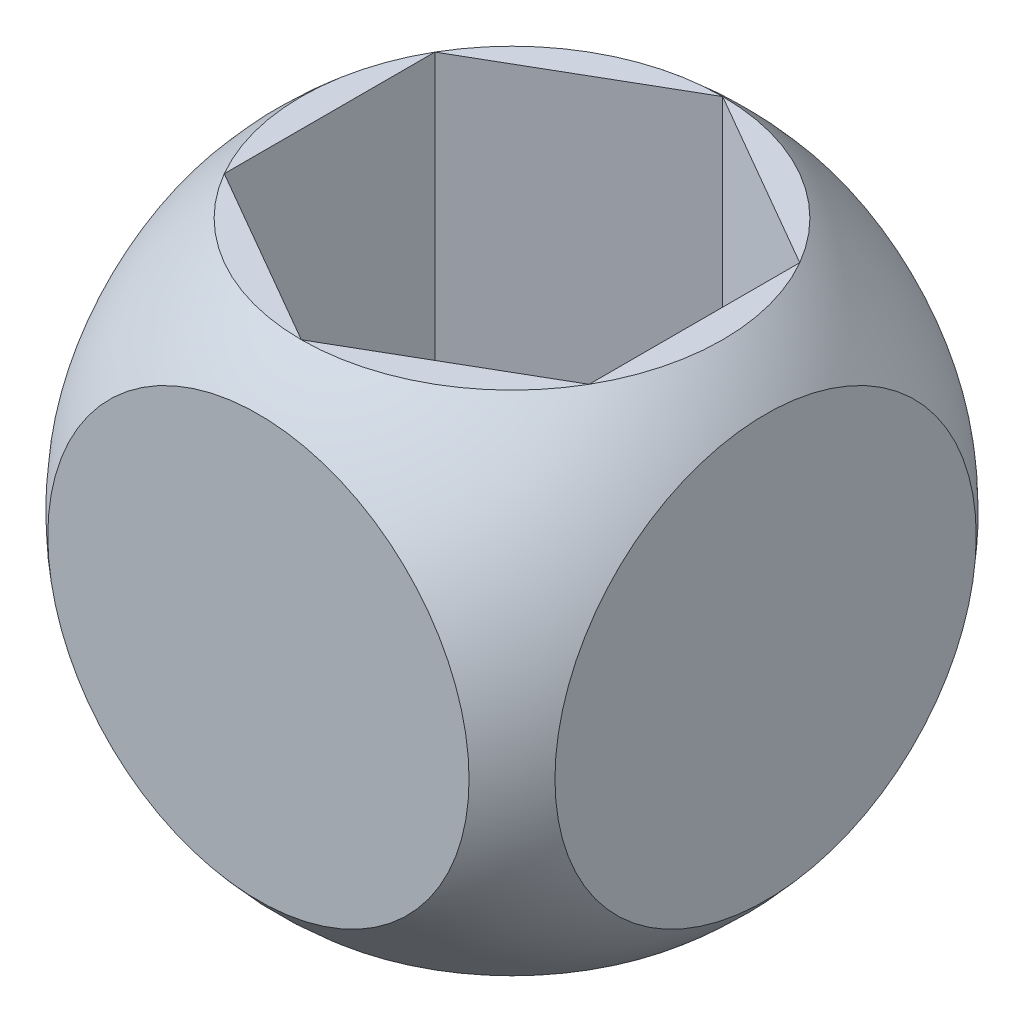
ISO-10303-21;
HEADER;
FILE_DESCRIPTION(('STEP AP214'),'2;1');
FILE_NAME('part.step','',(''),(''),'','','');
FILE_SCHEMA(('AUTOMOTIVE_DESIGN { 1 0 10303 214 1 1 1 1 }'));
ENDSEC;
DATA;
#1=APPLICATION_CONTEXT('core data for automotive mechanical design processes');
#2=APPLICATION_PROTOCOL_DEFINITION('international standard','automotive_design',2000,#1);
#3=PRODUCT_CONTEXT('',#1,'mechanical');
#4=PRODUCT('Part','Part','',(#3));
#5=PRODUCT_RELATED_PRODUCT_CATEGORY('part','',(#4));
#6=PRODUCT_DEFINITION_FORMATION('','',#4);
#7=PRODUCT_DEFINITION_CONTEXT('part definition',#1,'design');
#8=PRODUCT_DEFINITION('design','',#6,#7);
#9=PRODUCT_DEFINITION_SHAPE('','',#8);
#10=(LENGTH_UNIT() NAMED_UNIT(*) SI_UNIT(.MILLI.,.METRE.));
#11=(NAMED_UNIT(*) PLANE_ANGLE_UNIT() SI_UNIT($,.RADIAN.));
#12=(NAMED_UNIT(*) SI_UNIT($,.STERADIAN.) SOLID_ANGLE_UNIT());
#13=UNCERTAINTY_MEASURE_WITH_UNIT(LENGTH_MEASURE(1.E-05),#10,'distance_accuracy_value','');
#14=(GEOMETRIC_REPRESENTATION_CONTEXT(3) GLOBAL_UNCERTAINTY_ASSIGNED_CONTEXT((#13)) GLOBAL_UNIT_ASSIGNED_CONTEXT((#10,
#11,#12)) REPRESENTATION_CONTEXT('',''));
#15=CARTESIAN_POINT('',(0.,0.,0.));
#16=DIRECTION('',(0.,0.,1.));
#17=DIRECTION('',(1.,0.,0.));
#18=AXIS2_PLACEMENT_3D('',#15,#16,#17);
#19=CARTESIAN_POINT('',(50.,50.,-50.));
#20=DIRECTION('',(0.,1.,0.));
#21=DIRECTION('',(-1.,0.,0.));
#22=AXIS2_PLACEMENT_3D('',#19,#20,#21);
#23=PLANE('',#22);
#24=DIRECTION('',(-0.866025403784442,0.,-0.499999999999995));
#25=VECTOR('',#24,1.);
#26=CARTESIAN_POINT('',(35.9687364248451,50.,-20.7665596572956));
#27=LINE('',#26,#25);
#28=CARTESIAN_POINT('',(35.9687364248451,50.,-20.7665596572956));
#29=VERTEX_POINT('',#28);
#30=CARTESIAN_POINT('',(0.,50.,-41.5331193145904));
#31=VERTEX_POINT('',#30);
#32=EDGE_CURVE('E50',#29,#31,#27,.T.);
#33=ORIENTED_EDGE('',*,*,#32,.F.);
#34=CARTESIAN_POINT('',(0.,50.,0.));
#35=DIRECTION('',(0.,1.,0.));
#36=DIRECTION('',(-1.,0.,0.));
#37=AXIS2_PLACEMENT_3D('',#34,#35,#36);
#38=CIRCLE('',#37,41.5331193145904);
#39=EDGE_CURVE('E124',#29,#31,#38,.T.);
#40=ORIENTED_EDGE('',*,*,#39,.T.);
#41=EDGE_LOOP('',(#33,#40));
#42=FACE_BOUND('',#41,.T.);
#43=ADVANCED_FACE('F33',(#42),#23,.T.);
#44=DIRECTION('',(0.,0.,-1.));
#45=VECTOR('',#44,1.);
#46=CARTESIAN_POINT('',(35.9687364248456,50.,20.7665596572949));
#47=LINE('',#46,#45);
#48=CARTESIAN_POINT('',(35.9687364248456,50.,20.7665596572949));
#49=VERTEX_POINT('',#48);
#50=EDGE_CURVE('E166',#49,#29,#47,.T.);
#51=ORIENTED_EDGE('',*,*,#50,.F.);
#52=EDGE_CURVE('E125',#49,#29,#38,.T.);
#53=ORIENTED_EDGE('',*,*,#52,.T.);
#54=EDGE_LOOP('',(#51,#53));
#55=FACE_BOUND('',#54,.T.);
#56=ADVANCED_FACE('F203',(#55),#23,.T.);
#57=DIRECTION('',(0.866025403784435,0.,-0.500000000000007));
#58=VECTOR('',#57,1.);
#59=CARTESIAN_POINT('',(2.83085328157768E-13,50.,41.5331193145904));
#60=LINE('',#59,#58);
#61=CARTESIAN_POINT('',(2.83085328157768E-13,50.,41.5331193145904));
#62=VERTEX_POINT('',#61);
#63=EDGE_CURVE('E176',#62,#49,#60,.T.);
#64=ORIENTED_EDGE('',*,*,#63,.F.);
#65=EDGE_CURVE('E126',#62,#49,#38,.T.);
#66=ORIENTED_EDGE('',*,*,#65,.T.);
#67=EDGE_LOOP('',(#64,#66));
#68=FACE_BOUND('',#67,.T.);
#69=ADVANCED_FACE('F189',(#68),#23,.T.);
#70=DIRECTION('',(0.866025403784442,0.,0.499999999999995));
#71=VECTOR('',#70,1.);
#72=CARTESIAN_POINT('',(-35.9687364248453,50.,20.7665596572953));
#73=LINE('',#72,#71);
#74=CARTESIAN_POINT('',(-35.9687364248453,50.,20.7665596572953));
#75=VERTEX_POINT('',#74);
#76=EDGE_CURVE('E112',#75,#62,#73,.T.);
#77=ORIENTED_EDGE('',*,*,#76,.F.);
#78=EDGE_CURVE('E42',#75,#62,#38,.T.);
#79=ORIENTED_EDGE('',*,*,#78,.T.);
#80=EDGE_LOOP('',(#77,#79));
#81=FACE_BOUND('',#80,.T.);
#82=ADVANCED_FACE('F195',(#81),#23,.T.);
#83=DIRECTION('',(0.,0.,1.));
#84=VECTOR('',#83,1.);
#85=CARTESIAN_POINT('',(-35.9687364248454,50.,-20.7665596572951));
#86=LINE('',#85,#84);
#87=CARTESIAN_POINT('',(-35.9687364248454,50.,-20.7665596572951));
#88=VERTEX_POINT('',#87);
#89=EDGE_CURVE('E91',#88,#75,#86,.T.);
#90=ORIENTED_EDGE('',*,*,#89,.F.);
#91=EDGE_CURVE('E110',#88,#75,#38,.T.);
#92=ORIENTED_EDGE('',*,*,#91,.T.);
#93=EDGE_LOOP('',(#90,#92));
#94=FACE_BOUND('',#93,.T.);
#95=ADVANCED_FACE('F109',(#94),#23,.T.);
#96=CARTESIAN_POINT('',(50.,-50.,-50.));
#97=DIRECTION('',(0.,-1.,0.));
#98=DIRECTION('',(1.,0.,0.));
#99=AXIS2_PLACEMENT_3D('',#96,#97,#98);
#100=PLANE('',#99);
#101=DIRECTION('',(0.866025403784442,0.,0.499999999999995));
#102=VECTOR('',#101,1.);
#103=CARTESIAN_POINT('',(33.833733117812,-50.,-21.9992043913319));
#104=LINE('',#103,#102);
#105=CARTESIAN_POINT('',(0.,-50.,-41.5331193145904));
#106=VERTEX_POINT('',#105);
#107=CARTESIAN_POINT('',(35.9687364248452,-50.,-20.7665596572956));
#108=VERTEX_POINT('',#107);
#109=EDGE_CURVE('E153',#106,#108,#104,.T.);
#110=ORIENTED_EDGE('',*,*,#109,.F.);
#111=CARTESIAN_POINT('',(0.,-50.,0.));
#112=DIRECTION('',(0.,-1.,0.));
#113=DIRECTION('',(1.,0.,0.));
#114=AXIS2_PLACEMENT_3D('',#111,#112,#113);
#115=CIRCLE('',#114,41.5331193145904);
#116=EDGE_CURVE('E140',#106,#108,#115,.T.);
#117=ORIENTED_EDGE('',*,*,#116,.T.);
#118=EDGE_LOOP('',(#110,#117));
#119=FACE_BOUND('',#118,.T.);
#120=ADVANCED_FACE('F202',(#119),#100,.T.);
#121=DIRECTION('',(0.,0.,1.));
#122=VECTOR('',#121,1.);
#123=CARTESIAN_POINT('',(35.9687364248448,-50.,-49.9999999999999));
#124=LINE('',#123,#122);
#125=CARTESIAN_POINT('',(35.9687364248456,-50.,20.7665596572949));
#126=VERTEX_POINT('',#125);
#127=EDGE_CURVE('E156',#108,#126,#124,.T.);
#128=ORIENTED_EDGE('',*,*,#127,.F.);
#129=EDGE_CURVE('E133',#108,#126,#115,.T.);
#130=ORIENTED_EDGE('',*,*,#129,.T.);
#131=EDGE_LOOP('',(#128,#130));
#132=FACE_BOUND('',#131,.T.);
#133=ADVANCED_FACE('F257',(#132),#100,.T.);
#134=DIRECTION('',(-0.866025403784435,0.,0.500000000000007));
#135=VECTOR('',#134,1.);
#136=CARTESIAN_POINT('',(77.1350033070338,-50.,-3.0007956086689));
#137=LINE('',#136,#135);
#138=CARTESIAN_POINT('',(2.8796409701215E-13,-50.,41.5331193145904));
#139=VERTEX_POINT('',#138);
#140=EDGE_CURVE('E158',#126,#139,#137,.T.);
#141=ORIENTED_EDGE('',*,*,#140,.F.);
#142=EDGE_CURVE('E37',#126,#139,#115,.T.);
#143=ORIENTED_EDGE('',*,*,#142,.T.);
#144=EDGE_LOOP('',(#141,#143));
#145=FACE_BOUND('',#144,.T.);
#146=ADVANCED_FACE('F254',(#145),#100,.T.);
#147=DIRECTION('',(-0.866025403784442,0.,-0.499999999999995));
#148=VECTOR('',#147,1.);
#149=CARTESIAN_POINT('',(-2.13500330703307,-50.,40.3004745805539));
#150=LINE('',#149,#148);
#151=CARTESIAN_POINT('',(-35.9687364248453,-50.,20.7665596572953));
#152=VERTEX_POINT('',#151);
#153=EDGE_CURVE('E160',#139,#152,#150,.T.);
#154=ORIENTED_EDGE('',*,*,#153,.F.);
#155=EDGE_CURVE('E132',#139,#152,#115,.T.);
#156=ORIENTED_EDGE('',*,*,#155,.T.);
#157=EDGE_LOOP('',(#154,#156));
#158=FACE_BOUND('',#157,.T.);
#159=ADVANCED_FACE('F256',(#158),#100,.T.);
#160=DIRECTION('',(0.,0.,-1.));
#161=VECTOR('',#160,1.);
#162=CARTESIAN_POINT('',(-35.9687364248455,-50.,-49.9999999999997));
#163=LINE('',#162,#161);
#164=CARTESIAN_POINT('',(-35.9687364248455,-50.,-20.7665596572951));
#165=VERTEX_POINT('',#164);
#166=EDGE_CURVE('E94',#152,#165,#163,.T.);
#167=ORIENTED_EDGE('',*,*,#166,.F.);
#168=EDGE_CURVE('E138',#152,#165,#115,.T.);
#169=ORIENTED_EDGE('',*,*,#168,.T.);
#170=EDGE_LOOP('',(#167,#169));
#171=FACE_BOUND('',#170,.T.);
#172=ADVANCED_FACE('F220',(#171),#100,.T.);
#173=CARTESIAN_POINT('',(-50.,-50.,-50.));
#174=DIRECTION('',(-1.,0.,0.));
#175=DIRECTION('',(0.,0.,1.));
#176=AXIS2_PLACEMENT_3D('',#173,#174,#175);
#177=PLANE('',#176);
#178=CARTESIAN_POINT('',(-50.,0.,0.));
#179=DIRECTION('',(-1.,0.,0.));
#180=DIRECTION('',(0.,0.,1.));
#181=AXIS2_PLACEMENT_3D('',#178,#179,#180);
#182=CIRCLE('',#181,41.5331193145904);
#183=CARTESIAN_POINT('',(-50.,0.,41.5331193145904));
#184=VERTEX_POINT('',#183);
#185=EDGE_CURVE('E11',#184,#184,#182,.T.);
#186=ORIENTED_EDGE('',*,*,#185,.T.);
#187=EDGE_LOOP('',(#186));
#188=FACE_BOUND('',#187,.T.);
#189=ADVANCED_FACE('F214',(#188),#177,.T.);
#190=DIRECTION('',(-0.866025403784438,0.,0.500000000000001));
#191=VECTOR('',#190,1.);
#192=CARTESIAN_POINT('',(0.,50.,-41.5331193145904));
#193=LINE('',#192,#191);
#194=EDGE_CURVE('E100',#31,#88,#193,.T.);
#195=ORIENTED_EDGE('',*,*,#194,.F.);
#196=EDGE_CURVE('E117',#31,#88,#38,.T.);
#197=ORIENTED_EDGE('',*,*,#196,.T.);
#198=EDGE_LOOP('',(#195,#197));
#199=FACE_BOUND('',#198,.T.);
#200=ADVANCED_FACE('F123',(#199),#23,.T.);
#201=CARTESIAN_POINT('',(50.,-50.,-50.));
#202=DIRECTION('',(1.,0.,0.));
#203=DIRECTION('',(0.,0.,-1.));
#204=AXIS2_PLACEMENT_3D('',#201,#202,#203);
#205=PLANE('',#204);
#206=CARTESIAN_POINT('',(50.,0.,0.));
#207=DIRECTION('',(1.,0.,0.));
#208=DIRECTION('',(0.,0.,-1.));
#209=AXIS2_PLACEMENT_3D('',#206,#207,#208);
#210=CIRCLE('',#209,41.5331193145904);
#211=CARTESIAN_POINT('',(50.,0.,-41.5331193145904));
#212=VERTEX_POINT('',#211);
#213=EDGE_CURVE('E121',#212,#212,#210,.T.);
#214=ORIENTED_EDGE('',*,*,#213,.T.);
#215=EDGE_LOOP('',(#214));
#216=FACE_BOUND('',#215,.T.);
#217=ADVANCED_FACE('F213',(#216),#205,.T.);
#218=DIRECTION('',(0.866025403784438,0.,-0.500000000000001));
#219=VECTOR('',#218,1.);
#220=CARTESIAN_POINT('',(41.1662668821882,-50.,-65.3004745805538));
#221=LINE('',#220,#219);
#222=EDGE_CURVE('E163',#165,#106,#221,.T.);
#223=ORIENTED_EDGE('',*,*,#222,.F.);
#224=EDGE_CURVE('E146',#165,#106,#115,.T.);
#225=ORIENTED_EDGE('',*,*,#224,.T.);
#226=EDGE_LOOP('',(#223,#225));
#227=FACE_BOUND('',#226,.T.);
#228=ADVANCED_FACE('F215',(#227),#100,.T.);
#229=CARTESIAN_POINT('',(0.,0.,-50.));
#230=DIRECTION('',(0.,0.,1.));
#231=DIRECTION('',(1.,0.,0.));
#232=AXIS2_PLACEMENT_3D('',#229,#230,#231);
#233=PLANE('',#232);
#234=CARTESIAN_POINT('',(0.,0.,-50.));
#235=DIRECTION('',(0.,0.,1.));
#236=DIRECTION('',(1.,0.,0.));
#237=AXIS2_PLACEMENT_3D('',#234,#235,#236);
#238=CIRCLE('',#237,41.5331193145904);
#239=CARTESIAN_POINT('',(41.5331193145904,0.,-50.));
#240=VERTEX_POINT('',#239);
#241=EDGE_CURVE('E141',#240,#240,#238,.T.);
#242=ORIENTED_EDGE('',*,*,#241,.F.);
#243=EDGE_LOOP('',(#242));
#244=FACE_BOUND('',#243,.T.);
#245=ADVANCED_FACE('F35',(#244),#233,.F.);
#246=CARTESIAN_POINT('',(0.,0.,50.));
#247=DIRECTION('',(0.,0.,1.));
#248=DIRECTION('',(1.,0.,0.));
#249=AXIS2_PLACEMENT_3D('',#246,#247,#248);
#250=PLANE('',#249);
#251=CARTESIAN_POINT('',(0.,0.,50.));
#252=DIRECTION('',(0.,0.,1.));
#253=DIRECTION('',(1.,0.,0.));
#254=AXIS2_PLACEMENT_3D('',#251,#252,#253);
#255=CIRCLE('',#254,41.5331193145904);
#256=CARTESIAN_POINT('',(41.5331193145904,0.,50.));
#257=VERTEX_POINT('',#256);
#258=EDGE_CURVE('E148',#257,#257,#255,.T.);
#259=ORIENTED_EDGE('',*,*,#258,.T.);
#260=EDGE_LOOP('',(#259));
#261=FACE_BOUND('',#260,.T.);
#262=ADVANCED_FACE('F224',(#261),#250,.T.);
#263=CARTESIAN_POINT('',(0.,0.,0.));
#264=DIRECTION('',(-1.,0.,0.));
#265=DIRECTION('',(0.,1.,0.));
#266=AXIS2_PLACEMENT_3D('',#263,#264,#265);
#267=SPHERICAL_SURFACE('',#266,65.);
#268=ORIENTED_EDGE('',*,*,#185,.F.);
#269=EDGE_LOOP('',(#268));
#270=FACE_BOUND('',#269,.T.);
#271=ORIENTED_EDGE('',*,*,#213,.F.);
#272=EDGE_LOOP('',(#271));
#273=FACE_BOUND('',#272,.T.);
#274=ORIENTED_EDGE('',*,*,#258,.F.);
#275=EDGE_LOOP('',(#274));
#276=FACE_BOUND('',#275,.T.);
#277=ORIENTED_EDGE('',*,*,#241,.T.);
#278=EDGE_LOOP('',(#277));
#279=FACE_BOUND('',#278,.T.);
#280=ORIENTED_EDGE('',*,*,#142,.F.);
#281=ORIENTED_EDGE('',*,*,#129,.F.);
#282=ORIENTED_EDGE('',*,*,#116,.F.);
#283=ORIENTED_EDGE('',*,*,#224,.F.);
#284=ORIENTED_EDGE('',*,*,#168,.F.);
#285=ORIENTED_EDGE('',*,*,#155,.F.);
#286=EDGE_LOOP('',(#280,#281,#282,#283,#284,#285));
#287=FACE_BOUND('',#286,.T.);
#288=ORIENTED_EDGE('',*,*,#78,.F.);
#289=ORIENTED_EDGE('',*,*,#91,.F.);
#290=ORIENTED_EDGE('',*,*,#196,.F.);
#291=ORIENTED_EDGE('',*,*,#39,.F.);
#292=ORIENTED_EDGE('',*,*,#52,.F.);
#293=ORIENTED_EDGE('',*,*,#65,.F.);
#294=EDGE_LOOP('',(#288,#289,#290,#291,#292,#293));
#295=FACE_BOUND('',#294,.T.);
#296=ADVANCED_FACE('F115',(#270,#273,#276,#279,#287,#295),#267,.T.);
#297=CARTESIAN_POINT('',(35.9687364248452,-65.,-20.7665596572956));
#298=DIRECTION('',(0.499999999999995,0.,-0.866025403784441));
#299=DIRECTION('',(-0.866025403784442,0.,-0.499999999999995));
#300=AXIS2_PLACEMENT_3D('',#297,#298,#299);
#301=PLANE('',#300);
#302=ORIENTED_EDGE('',*,*,#109,.T.);
#303=DIRECTION('',(0.,1.,0.));
#304=VECTOR('',#303,1.);
#305=CARTESIAN_POINT('',(35.9687364248452,-65.,-20.7665596572956));
#306=LINE('',#305,#304);
#307=EDGE_CURVE('E165',#108,#29,#306,.T.);
#308=ORIENTED_EDGE('',*,*,#307,.T.);
#309=ORIENTED_EDGE('',*,*,#32,.T.);
#310=DIRECTION('',(0.,1.,0.));
#311=VECTOR('',#310,1.);
#312=CARTESIAN_POINT('',(0.,-65.,-41.5331193145904));
#313=LINE('',#312,#311);
#314=EDGE_CURVE('E97',#106,#31,#313,.T.);
#315=ORIENTED_EDGE('',*,*,#314,.F.);
#316=EDGE_LOOP('',(#302,#308,#309,#315));
#317=FACE_BOUND('',#316,.T.);
#318=ADVANCED_FACE('F226',(#317),#301,.F.);
#319=CARTESIAN_POINT('',(35.9687364248456,-65.,20.7665596572949));
#320=DIRECTION('',(1.,0.,0.));
#321=DIRECTION('',(0.,0.,-1.));
#322=AXIS2_PLACEMENT_3D('',#319,#320,#321);
#323=PLANE('',#322);
#324=ORIENTED_EDGE('',*,*,#127,.T.);
#325=DIRECTION('',(0.,1.,0.));
#326=VECTOR('',#325,1.);
#327=CARTESIAN_POINT('',(35.9687364248456,-65.,20.7665596572949));
#328=LINE('',#327,#326);
#329=EDGE_CURVE('E171',#126,#49,#328,.T.);
#330=ORIENTED_EDGE('',*,*,#329,.T.);
#331=ORIENTED_EDGE('',*,*,#50,.T.);
#332=ORIENTED_EDGE('',*,*,#307,.F.);
#333=EDGE_LOOP('',(#324,#330,#331,#332));
#334=FACE_BOUND('',#333,.T.);
#335=ADVANCED_FACE('F233',(#334),#323,.F.);
#336=CARTESIAN_POINT('',(2.99044784136755E-13,-65.,41.5331193145904));
#337=DIRECTION('',(0.500000000000007,0.,0.866025403784434));
#338=DIRECTION('',(0.866025403784435,0.,-0.500000000000007));
#339=AXIS2_PLACEMENT_3D('',#336,#337,#338);
#340=PLANE('',#339);
#341=ORIENTED_EDGE('',*,*,#140,.T.);
#342=DIRECTION('',(0.,1.,0.));
#343=VECTOR('',#342,1.);
#344=CARTESIAN_POINT('',(2.99044784136755E-13,-65.,41.5331193145904));
#345=LINE('',#344,#343);
#346=EDGE_CURVE('E169',#139,#62,#345,.T.);
#347=ORIENTED_EDGE('',*,*,#346,.T.);
#348=ORIENTED_EDGE('',*,*,#63,.T.);
#349=ORIENTED_EDGE('',*,*,#329,.F.);
#350=EDGE_LOOP('',(#341,#347,#348,#349));
#351=FACE_BOUND('',#350,.T.);
#352=ADVANCED_FACE('F246',(#351),#340,.F.);
#353=CARTESIAN_POINT('',(-35.9687364248453,-65.,20.7665596572953));
#354=DIRECTION('',(-0.499999999999995,0.,0.866025403784441));
#355=DIRECTION('',(0.866025403784442,0.,0.499999999999995));
#356=AXIS2_PLACEMENT_3D('',#353,#354,#355);
#357=PLANE('',#356);
#358=ORIENTED_EDGE('',*,*,#153,.T.);
#359=DIRECTION('',(0.,1.,0.));
#360=VECTOR('',#359,1.);
#361=CARTESIAN_POINT('',(-35.9687364248453,-65.,20.7665596572953));
#362=LINE('',#361,#360);
#363=EDGE_CURVE('E96',#152,#75,#362,.T.);
#364=ORIENTED_EDGE('',*,*,#363,.T.);
#365=ORIENTED_EDGE('',*,*,#76,.T.);
#366=ORIENTED_EDGE('',*,*,#346,.F.);
#367=EDGE_LOOP('',(#358,#364,#365,#366));
#368=FACE_BOUND('',#367,.T.);
#369=ADVANCED_FACE('F184',(#368),#357,.F.);
#370=CARTESIAN_POINT('',(-35.9687364248454,-65.,-20.7665596572951));
#371=DIRECTION('',(-1.,0.,0.));
#372=DIRECTION('',(0.,0.,1.));
#373=AXIS2_PLACEMENT_3D('',#370,#371,#372);
#374=PLANE('',#373);
#375=ORIENTED_EDGE('',*,*,#166,.T.);
#376=DIRECTION('',(0.,1.,0.));
#377=VECTOR('',#376,1.);
#378=CARTESIAN_POINT('',(-35.9687364248454,-65.,-20.7665596572951));
#379=LINE('',#378,#377);
#380=EDGE_CURVE('E58',#165,#88,#379,.T.);
#381=ORIENTED_EDGE('',*,*,#380,.T.);
#382=ORIENTED_EDGE('',*,*,#89,.T.);
#383=ORIENTED_EDGE('',*,*,#363,.F.);
#384=EDGE_LOOP('',(#375,#381,#382,#383));
#385=FACE_BOUND('',#384,.T.);
#386=ADVANCED_FACE('F88',(#385),#374,.F.);
#387=CARTESIAN_POINT('',(0.,-65.,-41.5331193145904));
#388=DIRECTION('',(-0.500000000000001,0.,-0.866025403784438));
#389=DIRECTION('',(-0.866025403784438,0.,0.500000000000001));
#390=AXIS2_PLACEMENT_3D('',#387,#388,#389);
#391=PLANE('',#390);
#392=ORIENTED_EDGE('',*,*,#222,.T.);
#393=ORIENTED_EDGE('',*,*,#314,.T.);
#394=ORIENTED_EDGE('',*,*,#194,.T.);
#395=ORIENTED_EDGE('',*,*,#380,.F.);
#396=EDGE_LOOP('',(#392,#393,#394,#395));
#397=FACE_BOUND('',#396,.T.);
#398=ADVANCED_FACE('F101',(#397),#391,.F.);
#399=CLOSED_SHELL('',(#43,#56,#69,#82,#95,#120,#133,#146,#159,#172,#189,#200,#217,#228,#245,
#262,#296,#318,#335,#352,#369,#386,#398));
#400=MANIFOLD_SOLID_BREP('B2',#399);
#401=ADVANCED_BREP_SHAPE_REPRESENTATION('',(#18,#400),#14);
#402=SHAPE_DEFINITION_REPRESENTATION(#9,#401);
ENDSEC;
END-ISO-10303-21;
